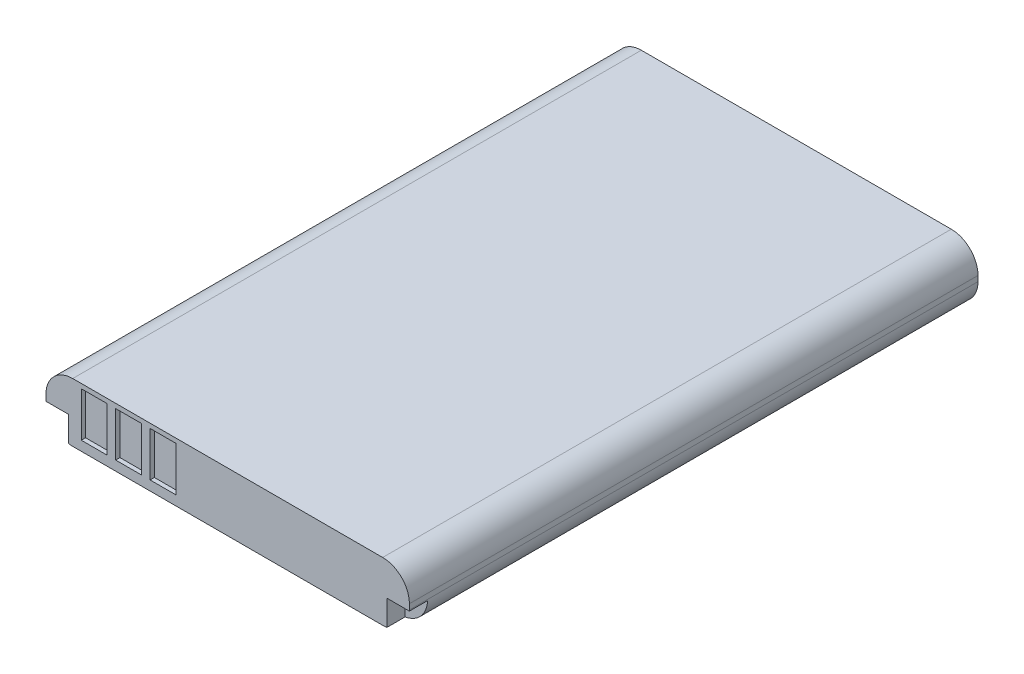
ISO-10303-21;
HEADER;
FILE_DESCRIPTION(('STEP AP214'),'2;1');
FILE_NAME('part.step','',(''),(''),'','','');
FILE_SCHEMA(('AUTOMOTIVE_DESIGN { 1 0 10303 214 1 1 1 1 }'));
ENDSEC;
DATA;
#1=APPLICATION_CONTEXT('core data for automotive mechanical design processes');
#2=APPLICATION_PROTOCOL_DEFINITION('international standard','automotive_design',2000,#1);
#3=PRODUCT_CONTEXT('',#1,'mechanical');
#4=PRODUCT('Part','Part','',(#3));
#5=PRODUCT_RELATED_PRODUCT_CATEGORY('part','',(#4));
#6=PRODUCT_DEFINITION_FORMATION('','',#4);
#7=PRODUCT_DEFINITION_CONTEXT('part definition',#1,'design');
#8=PRODUCT_DEFINITION('design','',#6,#7);
#9=PRODUCT_DEFINITION_SHAPE('','',#8);
#10=(LENGTH_UNIT() NAMED_UNIT(*) SI_UNIT(.MILLI.,.METRE.));
#11=(NAMED_UNIT(*) PLANE_ANGLE_UNIT() SI_UNIT($,.RADIAN.));
#12=(NAMED_UNIT(*) SI_UNIT($,.STERADIAN.) SOLID_ANGLE_UNIT());
#13=UNCERTAINTY_MEASURE_WITH_UNIT(LENGTH_MEASURE(1.E-05),#10,'distance_accuracy_value','');
#14=(GEOMETRIC_REPRESENTATION_CONTEXT(3) GLOBAL_UNCERTAINTY_ASSIGNED_CONTEXT((#13)) GLOBAL_UNIT_ASSIGNED_CONTEXT((#10,
#11,#12)) REPRESENTATION_CONTEXT('',''));
#15=CARTESIAN_POINT('',(0.,0.,0.));
#16=DIRECTION('',(0.,0.,1.));
#17=DIRECTION('',(1.,0.,0.));
#18=AXIS2_PLACEMENT_3D('',#15,#16,#17);
#19=CARTESIAN_POINT('',(-17.,5.5,26.6));
#20=DIRECTION('',(0.,0.,-1.));
#21=DIRECTION('',(-1.,0.,0.));
#22=AXIS2_PLACEMENT_3D('',#19,#20,#21);
#23=PLANE('',#22);
#24=DIRECTION('',(0.,1.,0.));
#25=VECTOR('',#24,1.);
#26=CARTESIAN_POINT('',(-4.86,0.9,26.6));
#27=LINE('',#26,#25);
#28=CARTESIAN_POINT('',(-4.86,0.9,26.6));
#29=VERTEX_POINT('',#28);
#30=CARTESIAN_POINT('',(-4.86,5.075,26.6));
#31=VERTEX_POINT('',#30);
#32=EDGE_CURVE('E421',#29,#31,#27,.T.);
#33=ORIENTED_EDGE('',*,*,#32,.F.);
#34=DIRECTION('',(1.,0.,0.));
#35=VECTOR('',#34,1.);
#36=CARTESIAN_POINT('',(-4.86,0.9,26.6));
#37=LINE('',#36,#35);
#38=CARTESIAN_POINT('',(-7.26,0.9,26.6));
#39=VERTEX_POINT('',#38);
#40=EDGE_CURVE('E423',#39,#29,#37,.T.);
#41=ORIENTED_EDGE('',*,*,#40,.F.);
#42=DIRECTION('',(0.,-1.,0.));
#43=VECTOR('',#42,1.);
#44=CARTESIAN_POINT('',(-7.26,0.9,26.6));
#45=LINE('',#44,#43);
#46=CARTESIAN_POINT('',(-7.26,5.075,26.6));
#47=VERTEX_POINT('',#46);
#48=EDGE_CURVE('E426',#47,#39,#45,.T.);
#49=ORIENTED_EDGE('',*,*,#48,.F.);
#50=DIRECTION('',(-1.,0.,0.));
#51=VECTOR('',#50,1.);
#52=CARTESIAN_POINT('',(-7.26,5.075,26.6));
#53=LINE('',#52,#51);
#54=EDGE_CURVE('E429',#31,#47,#53,.T.);
#55=ORIENTED_EDGE('',*,*,#54,.F.);
#56=EDGE_LOOP('',(#33,#41,#49,#55));
#57=FACE_BOUND('',#56,.T.);
#58=DIRECTION('',(-1.,0.,0.));
#59=VECTOR('',#58,1.);
#60=CARTESIAN_POINT('',(-13.7,5.075,26.6));
#61=LINE('',#60,#59);
#62=CARTESIAN_POINT('',(-11.3,5.075,26.6));
#63=VERTEX_POINT('',#62);
#64=CARTESIAN_POINT('',(-13.7,5.075,26.6));
#65=VERTEX_POINT('',#64);
#66=EDGE_CURVE('E341',#63,#65,#61,.T.);
#67=ORIENTED_EDGE('',*,*,#66,.F.);
#68=DIRECTION('',(0.,1.,0.));
#69=VECTOR('',#68,1.);
#70=CARTESIAN_POINT('',(-11.3,0.9,26.6));
#71=LINE('',#70,#69);
#72=CARTESIAN_POINT('',(-11.3,0.9,26.6));
#73=VERTEX_POINT('',#72);
#74=EDGE_CURVE('E325',#73,#63,#71,.T.);
#75=ORIENTED_EDGE('',*,*,#74,.F.);
#76=DIRECTION('',(1.,0.,0.));
#77=VECTOR('',#76,1.);
#78=CARTESIAN_POINT('',(-11.3,0.9,26.6));
#79=LINE('',#78,#77);
#80=CARTESIAN_POINT('',(-13.7,0.9,26.6));
#81=VERTEX_POINT('',#80);
#82=EDGE_CURVE('E330',#81,#73,#79,.T.);
#83=ORIENTED_EDGE('',*,*,#82,.F.);
#84=DIRECTION('',(0.,-1.,0.));
#85=VECTOR('',#84,1.);
#86=CARTESIAN_POINT('',(-13.7,0.9,26.6));
#87=LINE('',#86,#85);
#88=EDGE_CURVE('E344',#65,#81,#87,.T.);
#89=ORIENTED_EDGE('',*,*,#88,.F.);
#90=EDGE_LOOP('',(#67,#75,#83,#89));
#91=FACE_BOUND('',#90,.T.);
#92=DIRECTION('',(-1.,0.,0.));
#93=VECTOR('',#92,1.);
#94=CARTESIAN_POINT('',(-10.48,5.075,26.6));
#95=LINE('',#94,#93);
#96=CARTESIAN_POINT('',(-8.08,5.075,26.6));
#97=VERTEX_POINT('',#96);
#98=CARTESIAN_POINT('',(-10.48,5.075,26.6));
#99=VERTEX_POINT('',#98);
#100=EDGE_CURVE('E296',#97,#99,#95,.T.);
#101=ORIENTED_EDGE('',*,*,#100,.F.);
#102=DIRECTION('',(0.,1.,0.));
#103=VECTOR('',#102,1.);
#104=CARTESIAN_POINT('',(-8.08,0.9,26.6));
#105=LINE('',#104,#103);
#106=CARTESIAN_POINT('',(-8.08,0.9,26.6));
#107=VERTEX_POINT('',#106);
#108=EDGE_CURVE('E323',#107,#97,#105,.T.);
#109=ORIENTED_EDGE('',*,*,#108,.F.);
#110=DIRECTION('',(1.,0.,0.));
#111=VECTOR('',#110,1.);
#112=CARTESIAN_POINT('',(-8.08,0.9,26.6));
#113=LINE('',#112,#111);
#114=CARTESIAN_POINT('',(-10.48,0.9,26.6));
#115=VERTEX_POINT('',#114);
#116=EDGE_CURVE('E318',#115,#107,#113,.T.);
#117=ORIENTED_EDGE('',*,*,#116,.F.);
#118=DIRECTION('',(0.,-1.,0.));
#119=VECTOR('',#118,1.);
#120=CARTESIAN_POINT('',(-10.48,0.9,26.6));
#121=LINE('',#120,#119);
#122=EDGE_CURVE('E313',#99,#115,#121,.T.);
#123=ORIENTED_EDGE('',*,*,#122,.F.);
#124=EDGE_LOOP('',(#101,#109,#117,#123));
#125=FACE_BOUND('',#124,.T.);
#126=DIRECTION('',(0.,1.,0.));
#127=VECTOR('',#126,1.);
#128=CARTESIAN_POINT('',(14.9,0.,26.6));
#129=LINE('',#128,#127);
#130=CARTESIAN_POINT('',(14.9,0.0322074641493867,26.6));
#131=VERTEX_POINT('',#130);
#132=CARTESIAN_POINT('',(14.9,2.4,26.6));
#133=VERTEX_POINT('',#132);
#134=EDGE_CURVE('E269',#131,#133,#129,.T.);
#135=ORIENTED_EDGE('',*,*,#134,.T.);
#136=DIRECTION('',(1.,0.,0.));
#137=VECTOR('',#136,1.);
#138=CARTESIAN_POINT('',(14.9,2.4,26.6));
#139=LINE('',#138,#137);
#140=CARTESIAN_POINT('',(16.9979991993594,2.4,26.6));
#141=VERTEX_POINT('',#140);
#142=EDGE_CURVE('E275',#133,#141,#139,.T.);
#143=ORIENTED_EDGE('',*,*,#142,.T.);
#144=CARTESIAN_POINT('',(14.5,2.5,26.6));
#145=DIRECTION('',(0.,0.,-1.));
#146=DIRECTION('',(-1.,0.,0.));
#147=AXIS2_PLACEMENT_3D('',#144,#145,#146);
#148=CIRCLE('',#147,2.5);
#149=CARTESIAN_POINT('',(17.,2.5,26.6));
#150=VERTEX_POINT('',#149);
#151=EDGE_CURVE('E388',#141,#150,#148,.F.);
#152=ORIENTED_EDGE('',*,*,#151,.T.);
#153=DIRECTION('',(0.,-1.,0.));
#154=VECTOR('',#153,1.);
#155=CARTESIAN_POINT('',(17.,5.5,26.6));
#156=LINE('',#155,#154);
#157=CARTESIAN_POINT('',(17.,3.,26.6));
#158=VERTEX_POINT('',#157);
#159=EDGE_CURVE('E365',#158,#150,#156,.T.);
#160=ORIENTED_EDGE('',*,*,#159,.F.);
#161=CARTESIAN_POINT('',(14.5,3.,26.6));
#162=DIRECTION('',(0.,0.,-1.));
#163=DIRECTION('',(-1.,0.,0.));
#164=AXIS2_PLACEMENT_3D('',#161,#162,#163);
#165=CIRCLE('',#164,2.5);
#166=CARTESIAN_POINT('',(14.5,5.5,26.6));
#167=VERTEX_POINT('',#166);
#168=EDGE_CURVE('E386',#158,#167,#165,.F.);
#169=ORIENTED_EDGE('',*,*,#168,.T.);
#170=DIRECTION('',(1.,0.,0.));
#171=VECTOR('',#170,1.);
#172=CARTESIAN_POINT('',(-17.,5.5,26.6));
#173=LINE('',#172,#171);
#174=CARTESIAN_POINT('',(-14.5,5.5,26.6));
#175=VERTEX_POINT('',#174);
#176=EDGE_CURVE('E361',#175,#167,#173,.T.);
#177=ORIENTED_EDGE('',*,*,#176,.F.);
#178=CARTESIAN_POINT('',(-14.5,3.,26.6));
#179=DIRECTION('',(0.,0.,-1.));
#180=DIRECTION('',(-1.,0.,0.));
#181=AXIS2_PLACEMENT_3D('',#178,#179,#180);
#182=CIRCLE('',#181,2.5);
#183=CARTESIAN_POINT('',(-17.,3.,26.6));
#184=VERTEX_POINT('',#183);
#185=EDGE_CURVE('E392',#175,#184,#182,.F.);
#186=ORIENTED_EDGE('',*,*,#185,.T.);
#187=DIRECTION('',(0.,-1.,0.));
#188=VECTOR('',#187,1.);
#189=CARTESIAN_POINT('',(-17.,5.5,26.6));
#190=LINE('',#189,#188);
#191=CARTESIAN_POINT('',(-17.,2.5,26.6));
#192=VERTEX_POINT('',#191);
#193=EDGE_CURVE('E372',#184,#192,#190,.T.);
#194=ORIENTED_EDGE('',*,*,#193,.T.);
#195=CARTESIAN_POINT('',(-14.5,2.5,26.6));
#196=DIRECTION('',(0.,0.,-1.));
#197=DIRECTION('',(-1.,0.,0.));
#198=AXIS2_PLACEMENT_3D('',#195,#196,#197);
#199=CIRCLE('',#198,2.5);
#200=CARTESIAN_POINT('',(-16.9979991993594,2.4,26.6));
#201=VERTEX_POINT('',#200);
#202=EDGE_CURVE('E395',#192,#201,#199,.F.);
#203=ORIENTED_EDGE('',*,*,#202,.T.);
#204=DIRECTION('',(-1.,0.,0.));
#205=VECTOR('',#204,1.);
#206=CARTESIAN_POINT('',(-14.9,2.4,26.6));
#207=LINE('',#206,#205);
#208=CARTESIAN_POINT('',(-14.9,2.4,26.6));
#209=VERTEX_POINT('',#208);
#210=EDGE_CURVE('E289',#209,#201,#207,.T.);
#211=ORIENTED_EDGE('',*,*,#210,.F.);
#212=DIRECTION('',(0.,1.,0.));
#213=VECTOR('',#212,1.);
#214=CARTESIAN_POINT('',(-14.9,0.,26.6));
#215=LINE('',#214,#213);
#216=CARTESIAN_POINT('',(-14.9,0.0322074641493867,26.6));
#217=VERTEX_POINT('',#216);
#218=EDGE_CURVE('E285',#217,#209,#215,.T.);
#219=ORIENTED_EDGE('',*,*,#218,.F.);
#220=CARTESIAN_POINT('',(-14.5,0.,26.6));
#221=VERTEX_POINT('',#220);
#222=EDGE_CURVE('E394',#217,#221,#199,.F.);
#223=ORIENTED_EDGE('',*,*,#222,.T.);
#224=DIRECTION('',(1.,0.,0.));
#225=VECTOR('',#224,1.);
#226=CARTESIAN_POINT('',(-17.,0.,26.6));
#227=LINE('',#226,#225);
#228=CARTESIAN_POINT('',(14.5,0.,26.6));
#229=VERTEX_POINT('',#228);
#230=EDGE_CURVE('E362',#221,#229,#227,.T.);
#231=ORIENTED_EDGE('',*,*,#230,.T.);
#232=EDGE_CURVE('E389',#229,#131,#148,.F.);
#233=ORIENTED_EDGE('',*,*,#232,.T.);
#234=EDGE_LOOP('',(#135,#143,#152,#160,#169,#177,#186,#194,#203,#211,#219,#223,#231,#233));
#235=FACE_BOUND('',#234,.T.);
#236=ADVANCED_FACE('F37',(#57,#91,#125,#235),#23,.F.);
#237=CARTESIAN_POINT('',(14.5,2.5,26.6));
#238=DIRECTION('',(0.,0.,1.));
#239=DIRECTION('',(1.,0.,0.));
#240=AXIS2_PLACEMENT_3D('',#237,#238,#239);
#241=CYLINDRICAL_SURFACE('',#240,2.5);
#242=CARTESIAN_POINT('',(14.5,2.5,24.9));
#243=DIRECTION('',(0.,0.,1.));
#244=DIRECTION('',(1.,0.,0.));
#245=AXIS2_PLACEMENT_3D('',#242,#243,#244);
#246=CIRCLE('',#245,2.5);
#247=CARTESIAN_POINT('',(16.9979991993594,2.4,24.9));
#248=VERTEX_POINT('',#247);
#249=CARTESIAN_POINT('',(14.9,0.0322074641493867,24.9));
#250=VERTEX_POINT('',#249);
#251=EDGE_CURVE('E464',#248,#250,#246,.F.);
#252=ORIENTED_EDGE('',*,*,#251,.T.);
#253=DIRECTION('',(0.,0.,1.));
#254=VECTOR('',#253,1.);
#255=CARTESIAN_POINT('',(14.9,0.0322074641493867,26.6));
#256=LINE('',#255,#254);
#257=EDGE_CURVE('E11',#250,#131,#256,.T.);
#258=ORIENTED_EDGE('',*,*,#257,.T.);
#259=ORIENTED_EDGE('',*,*,#232,.F.);
#260=DIRECTION('',(0.,0.,-1.));
#261=VECTOR('',#260,1.);
#262=CARTESIAN_POINT('',(14.5,0.,26.6));
#263=LINE('',#262,#261);
#264=CARTESIAN_POINT('',(14.5,0.,-26.6));
#265=VERTEX_POINT('',#264);
#266=EDGE_CURVE('E398',#265,#229,#263,.F.);
#267=ORIENTED_EDGE('',*,*,#266,.F.);
#268=CARTESIAN_POINT('',(14.5,2.5,-26.6));
#269=DIRECTION('',(0.,0.,1.));
#270=DIRECTION('',(1.,0.,0.));
#271=AXIS2_PLACEMENT_3D('',#268,#269,#270);
#272=CIRCLE('',#271,2.5);
#273=CARTESIAN_POINT('',(17.,2.5,-26.6));
#274=VERTEX_POINT('',#273);
#275=EDGE_CURVE('E404',#274,#265,#272,.F.);
#276=ORIENTED_EDGE('',*,*,#275,.F.);
#277=DIRECTION('',(0.,0.,-1.));
#278=VECTOR('',#277,1.);
#279=CARTESIAN_POINT('',(17.,2.5,-26.6));
#280=LINE('',#279,#278);
#281=EDGE_CURVE('E418',#150,#274,#280,.T.);
#282=ORIENTED_EDGE('',*,*,#281,.F.);
#283=ORIENTED_EDGE('',*,*,#151,.F.);
#284=DIRECTION('',(0.,0.,1.));
#285=VECTOR('',#284,1.);
#286=CARTESIAN_POINT('',(16.9979991993594,2.4,26.6));
#287=LINE('',#286,#285);
#288=EDGE_CURVE('E45',#141,#248,#287,.F.);
#289=ORIENTED_EDGE('',*,*,#288,.T.);
#290=EDGE_LOOP('',(#252,#258,#259,#267,#276,#282,#283,#289));
#291=FACE_BOUND('',#290,.T.);
#292=ADVANCED_FACE('F469',(#291),#241,.T.);
#293=CARTESIAN_POINT('',(6.44,0.,26.2));
#294=DIRECTION('',(0.,0.,-1.));
#295=DIRECTION('',(-1.,0.,0.));
#296=AXIS2_PLACEMENT_3D('',#293,#294,#295);
#297=PLANE('',#296);
#298=DIRECTION('',(0.,1.,0.));
#299=VECTOR('',#298,1.);
#300=CARTESIAN_POINT('',(-4.86,0.9,26.2));
#301=LINE('',#300,#299);
#302=CARTESIAN_POINT('',(-4.86,0.9,26.2));
#303=VERTEX_POINT('',#302);
#304=CARTESIAN_POINT('',(-4.86,5.075,26.2));
#305=VERTEX_POINT('',#304);
#306=EDGE_CURVE('E435',#303,#305,#301,.T.);
#307=ORIENTED_EDGE('',*,*,#306,.T.);
#308=DIRECTION('',(-1.,0.,0.));
#309=VECTOR('',#308,1.);
#310=CARTESIAN_POINT('',(-7.26,5.075,26.2));
#311=LINE('',#310,#309);
#312=CARTESIAN_POINT('',(-7.26,5.075,26.2));
#313=VERTEX_POINT('',#312);
#314=EDGE_CURVE('E453',#305,#313,#311,.T.);
#315=ORIENTED_EDGE('',*,*,#314,.T.);
#316=DIRECTION('',(0.,-1.,0.));
#317=VECTOR('',#316,1.);
#318=CARTESIAN_POINT('',(-7.26,0.9,26.2));
#319=LINE('',#318,#317);
#320=CARTESIAN_POINT('',(-7.26,0.9,26.2));
#321=VERTEX_POINT('',#320);
#322=EDGE_CURVE('E447',#313,#321,#319,.T.);
#323=ORIENTED_EDGE('',*,*,#322,.T.);
#324=DIRECTION('',(1.,0.,0.));
#325=VECTOR('',#324,1.);
#326=CARTESIAN_POINT('',(-4.86,0.9,26.2));
#327=LINE('',#326,#325);
#328=EDGE_CURVE('E441',#321,#303,#327,.T.);
#329=ORIENTED_EDGE('',*,*,#328,.T.);
#330=EDGE_LOOP('',(#307,#315,#323,#329));
#331=FACE_BOUND('',#330,.T.);
#332=ADVANCED_FACE('F39',(#331),#297,.F.);
#333=CARTESIAN_POINT('',(-7.26,5.075,26.2));
#334=DIRECTION('',(0.,1.,0.));
#335=DIRECTION('',(0.,0.,1.));
#336=AXIS2_PLACEMENT_3D('',#333,#334,#335);
#337=PLANE('',#336);
#338=ORIENTED_EDGE('',*,*,#54,.T.);
#339=DIRECTION('',(0.,0.,1.));
#340=VECTOR('',#339,1.);
#341=CARTESIAN_POINT('',(-7.26,5.075,26.2));
#342=LINE('',#341,#340);
#343=EDGE_CURVE('E450',#313,#47,#342,.T.);
#344=ORIENTED_EDGE('',*,*,#343,.F.);
#345=ORIENTED_EDGE('',*,*,#314,.F.);
#346=DIRECTION('',(0.,0.,1.));
#347=VECTOR('',#346,1.);
#348=CARTESIAN_POINT('',(-4.86,5.075,26.2));
#349=LINE('',#348,#347);
#350=EDGE_CURVE('E432',#305,#31,#349,.T.);
#351=ORIENTED_EDGE('',*,*,#350,.T.);
#352=EDGE_LOOP('',(#338,#344,#345,#351));
#353=FACE_BOUND('',#352,.T.);
#354=ADVANCED_FACE('F569',(#353),#337,.F.);
#355=CARTESIAN_POINT('',(-7.26,0.9,26.2));
#356=DIRECTION('',(-1.,0.,0.));
#357=DIRECTION('',(0.,0.,1.));
#358=AXIS2_PLACEMENT_3D('',#355,#356,#357);
#359=PLANE('',#358);
#360=ORIENTED_EDGE('',*,*,#48,.T.);
#361=DIRECTION('',(0.,0.,1.));
#362=VECTOR('',#361,1.);
#363=CARTESIAN_POINT('',(-7.26,0.9,26.2));
#364=LINE('',#363,#362);
#365=EDGE_CURVE('E444',#321,#39,#364,.T.);
#366=ORIENTED_EDGE('',*,*,#365,.F.);
#367=ORIENTED_EDGE('',*,*,#322,.F.);
#368=ORIENTED_EDGE('',*,*,#343,.T.);
#369=EDGE_LOOP('',(#360,#366,#367,#368));
#370=FACE_BOUND('',#369,.T.);
#371=ADVANCED_FACE('F566',(#370),#359,.F.);
#372=CARTESIAN_POINT('',(-4.86,0.9,26.2));
#373=DIRECTION('',(0.,-1.,0.));
#374=DIRECTION('',(1.,0.,0.));
#375=AXIS2_PLACEMENT_3D('',#372,#373,#374);
#376=PLANE('',#375);
#377=ORIENTED_EDGE('',*,*,#40,.T.);
#378=DIRECTION('',(0.,0.,1.));
#379=VECTOR('',#378,1.);
#380=CARTESIAN_POINT('',(-4.86,0.9,26.2));
#381=LINE('',#380,#379);
#382=EDGE_CURVE('E438',#303,#29,#381,.T.);
#383=ORIENTED_EDGE('',*,*,#382,.F.);
#384=ORIENTED_EDGE('',*,*,#328,.F.);
#385=ORIENTED_EDGE('',*,*,#365,.T.);
#386=EDGE_LOOP('',(#377,#383,#384,#385));
#387=FACE_BOUND('',#386,.T.);
#388=ADVANCED_FACE('F562',(#387),#376,.F.);
#389=CARTESIAN_POINT('',(-4.86,0.9,26.2));
#390=DIRECTION('',(1.,0.,0.));
#391=DIRECTION('',(0.,0.,-1.));
#392=AXIS2_PLACEMENT_3D('',#389,#390,#391);
#393=PLANE('',#392);
#394=ORIENTED_EDGE('',*,*,#32,.T.);
#395=ORIENTED_EDGE('',*,*,#350,.F.);
#396=ORIENTED_EDGE('',*,*,#306,.F.);
#397=ORIENTED_EDGE('',*,*,#382,.T.);
#398=EDGE_LOOP('',(#394,#395,#396,#397));
#399=FACE_BOUND('',#398,.T.);
#400=ADVANCED_FACE('F552',(#399),#393,.F.);
#401=CARTESIAN_POINT('',(17.,5.5,26.6));
#402=DIRECTION('',(-1.,0.,0.));
#403=DIRECTION('',(0.,0.,1.));
#404=AXIS2_PLACEMENT_3D('',#401,#402,#403);
#405=PLANE('',#404);
#406=ORIENTED_EDGE('',*,*,#159,.T.);
#407=ORIENTED_EDGE('',*,*,#281,.T.);
#408=DIRECTION('',(0.,-1.,0.));
#409=VECTOR('',#408,1.);
#410=CARTESIAN_POINT('',(17.,5.5,-26.6));
#411=LINE('',#410,#409);
#412=CARTESIAN_POINT('',(17.,3.,-26.6));
#413=VERTEX_POINT('',#412);
#414=EDGE_CURVE('E378',#413,#274,#411,.T.);
#415=ORIENTED_EDGE('',*,*,#414,.F.);
#416=DIRECTION('',(0.,0.,-1.));
#417=VECTOR('',#416,1.);
#418=CARTESIAN_POINT('',(17.,3.,26.6));
#419=LINE('',#418,#417);
#420=EDGE_CURVE('E416',#413,#158,#419,.F.);
#421=ORIENTED_EDGE('',*,*,#420,.T.);
#422=EDGE_LOOP('',(#406,#407,#415,#421));
#423=FACE_BOUND('',#422,.T.);
#424=ADVANCED_FACE('F500',(#423),#405,.F.);
#425=CARTESIAN_POINT('',(-17.,5.5,-26.6));
#426=DIRECTION('',(0.,0.,1.));
#427=DIRECTION('',(1.,0.,0.));
#428=AXIS2_PLACEMENT_3D('',#425,#426,#427);
#429=PLANE('',#428);
#430=DIRECTION('',(1.,0.,0.));
#431=VECTOR('',#430,1.);
#432=CARTESIAN_POINT('',(9.9,4.325,-26.6));
#433=LINE('',#432,#431);
#434=CARTESIAN_POINT('',(-9.9,4.325,-26.6));
#435=VERTEX_POINT('',#434);
#436=CARTESIAN_POINT('',(9.9,4.325,-26.6));
#437=VERTEX_POINT('',#436);
#438=EDGE_CURVE('E263',#435,#437,#433,.T.);
#439=ORIENTED_EDGE('',*,*,#438,.F.);
#440=DIRECTION('',(0.,1.,0.));
#441=VECTOR('',#440,1.);
#442=CARTESIAN_POINT('',(-9.9,1.175,-26.6));
#443=LINE('',#442,#441);
#444=CARTESIAN_POINT('',(-9.9,1.175,-26.6));
#445=VERTEX_POINT('',#444);
#446=EDGE_CURVE('E52',#445,#435,#443,.T.);
#447=ORIENTED_EDGE('',*,*,#446,.F.);
#448=DIRECTION('',(-1.,0.,0.));
#449=VECTOR('',#448,1.);
#450=CARTESIAN_POINT('',(9.9,1.175,-26.6));
#451=LINE('',#450,#449);
#452=CARTESIAN_POINT('',(9.9,1.175,-26.6));
#453=VERTEX_POINT('',#452);
#454=EDGE_CURVE('E254',#453,#445,#451,.T.);
#455=ORIENTED_EDGE('',*,*,#454,.F.);
#456=DIRECTION('',(0.,-1.,0.));
#457=VECTOR('',#456,1.);
#458=CARTESIAN_POINT('',(9.9,1.175,-26.6));
#459=LINE('',#458,#457);
#460=EDGE_CURVE('E257',#437,#453,#459,.T.);
#461=ORIENTED_EDGE('',*,*,#460,.F.);
#462=EDGE_LOOP('',(#439,#447,#455,#461));
#463=FACE_BOUND('',#462,.T.);
#464=DIRECTION('',(-1.,0.,0.));
#465=VECTOR('',#464,1.);
#466=CARTESIAN_POINT('',(-17.,0.,-26.6));
#467=LINE('',#466,#465);
#468=CARTESIAN_POINT('',(-14.5,0.,-26.6));
#469=VERTEX_POINT('',#468);
#470=EDGE_CURVE('E351',#265,#469,#467,.T.);
#471=ORIENTED_EDGE('',*,*,#470,.T.);
#472=CARTESIAN_POINT('',(-14.5,2.5,-26.6));
#473=DIRECTION('',(0.,0.,1.));
#474=DIRECTION('',(1.,0.,0.));
#475=AXIS2_PLACEMENT_3D('',#472,#473,#474);
#476=CIRCLE('',#475,2.5);
#477=CARTESIAN_POINT('',(-17.,2.5,-26.6));
#478=VERTEX_POINT('',#477);
#479=EDGE_CURVE('E408',#469,#478,#476,.F.);
#480=ORIENTED_EDGE('',*,*,#479,.T.);
#481=DIRECTION('',(0.,-1.,0.));
#482=VECTOR('',#481,1.);
#483=CARTESIAN_POINT('',(-17.,5.5,-26.6));
#484=LINE('',#483,#482);
#485=CARTESIAN_POINT('',(-17.,3.,-26.6));
#486=VERTEX_POINT('',#485);
#487=EDGE_CURVE('E375',#486,#478,#484,.T.);
#488=ORIENTED_EDGE('',*,*,#487,.F.);
#489=CARTESIAN_POINT('',(-14.5,3.,-26.6));
#490=DIRECTION('',(0.,0.,1.));
#491=DIRECTION('',(1.,0.,0.));
#492=AXIS2_PLACEMENT_3D('',#489,#490,#491);
#493=CIRCLE('',#492,2.5);
#494=CARTESIAN_POINT('',(-14.5,5.5,-26.6));
#495=VERTEX_POINT('',#494);
#496=EDGE_CURVE('E406',#486,#495,#493,.F.);
#497=ORIENTED_EDGE('',*,*,#496,.T.);
#498=DIRECTION('',(-1.,0.,0.));
#499=VECTOR('',#498,1.);
#500=CARTESIAN_POINT('',(-17.,5.5,-26.6));
#501=LINE('',#500,#499);
#502=CARTESIAN_POINT('',(14.5,5.5,-26.6));
#503=VERTEX_POINT('',#502);
#504=EDGE_CURVE('E358',#503,#495,#501,.T.);
#505=ORIENTED_EDGE('',*,*,#504,.F.);
#506=CARTESIAN_POINT('',(14.5,3.,-26.6));
#507=DIRECTION('',(0.,0.,1.));
#508=DIRECTION('',(1.,0.,0.));
#509=AXIS2_PLACEMENT_3D('',#506,#507,#508);
#510=CIRCLE('',#509,2.5);
#511=EDGE_CURVE('E402',#503,#413,#510,.F.);
#512=ORIENTED_EDGE('',*,*,#511,.T.);
#513=ORIENTED_EDGE('',*,*,#414,.T.);
#514=ORIENTED_EDGE('',*,*,#275,.T.);
#515=EDGE_LOOP('',(#471,#480,#488,#497,#505,#512,#513,#514));
#516=FACE_BOUND('',#515,.T.);
#517=ADVANCED_FACE('F494',(#463,#516),#429,.F.);
#518=CARTESIAN_POINT('',(-17.,5.5,26.6));
#519=DIRECTION('',(1.,0.,0.));
#520=DIRECTION('',(0.,0.,-1.));
#521=AXIS2_PLACEMENT_3D('',#518,#519,#520);
#522=PLANE('',#521);
#523=ORIENTED_EDGE('',*,*,#487,.T.);
#524=DIRECTION('',(0.,0.,1.));
#525=VECTOR('',#524,1.);
#526=CARTESIAN_POINT('',(-17.,2.5,26.6));
#527=LINE('',#526,#525);
#528=EDGE_CURVE('E383',#478,#192,#527,.T.);
#529=ORIENTED_EDGE('',*,*,#528,.T.);
#530=ORIENTED_EDGE('',*,*,#193,.F.);
#531=DIRECTION('',(0.,0.,1.));
#532=VECTOR('',#531,1.);
#533=CARTESIAN_POINT('',(-17.,3.,26.6));
#534=LINE('',#533,#532);
#535=EDGE_CURVE('E381',#184,#486,#534,.F.);
#536=ORIENTED_EDGE('',*,*,#535,.T.);
#537=EDGE_LOOP('',(#523,#529,#530,#536));
#538=FACE_BOUND('',#537,.T.);
#539=ADVANCED_FACE('F515',(#538),#522,.F.);
#540=CARTESIAN_POINT('',(0.,5.5,0.));
#541=DIRECTION('',(0.,-1.,0.));
#542=DIRECTION('',(0.,0.,-1.));
#543=AXIS2_PLACEMENT_3D('',#540,#541,#542);
#544=PLANE('',#543);
#545=ORIENTED_EDGE('',*,*,#504,.T.);
#546=DIRECTION('',(0.,0.,1.));
#547=VECTOR('',#546,1.);
#548=CARTESIAN_POINT('',(-14.5,5.5,0.));
#549=LINE('',#548,#547);
#550=EDGE_CURVE('E413',#495,#175,#549,.T.);
#551=ORIENTED_EDGE('',*,*,#550,.T.);
#552=ORIENTED_EDGE('',*,*,#176,.T.);
#553=DIRECTION('',(0.,0.,-1.));
#554=VECTOR('',#553,1.);
#555=CARTESIAN_POINT('',(14.5,5.5,0.));
#556=LINE('',#555,#554);
#557=EDGE_CURVE('E410',#167,#503,#556,.T.);
#558=ORIENTED_EDGE('',*,*,#557,.T.);
#559=EDGE_LOOP('',(#545,#551,#552,#558));
#560=FACE_BOUND('',#559,.T.);
#561=ADVANCED_FACE('F507',(#560),#544,.F.);
#562=CARTESIAN_POINT('',(0.,0.,0.));
#563=DIRECTION('',(0.,-1.,0.));
#564=DIRECTION('',(0.,0.,-1.));
#565=AXIS2_PLACEMENT_3D('',#562,#563,#564);
#566=PLANE('',#565);
#567=ORIENTED_EDGE('',*,*,#230,.F.);
#568=DIRECTION('',(0.,0.,1.));
#569=VECTOR('',#568,1.);
#570=CARTESIAN_POINT('',(-14.5,0.,-26.6));
#571=LINE('',#570,#569);
#572=EDGE_CURVE('E400',#221,#469,#571,.F.);
#573=ORIENTED_EDGE('',*,*,#572,.T.);
#574=ORIENTED_EDGE('',*,*,#470,.F.);
#575=ORIENTED_EDGE('',*,*,#266,.T.);
#576=EDGE_LOOP('',(#567,#573,#574,#575));
#577=FACE_BOUND('',#576,.T.);
#578=ADVANCED_FACE('F483',(#577),#566,.T.);
#579=CARTESIAN_POINT('',(-14.5,2.5,26.6));
#580=DIRECTION('',(0.,0.,-1.));
#581=DIRECTION('',(-1.,0.,0.));
#582=AXIS2_PLACEMENT_3D('',#579,#580,#581);
#583=CYLINDRICAL_SURFACE('',#582,2.5);
#584=DIRECTION('',(0.,0.,-1.));
#585=VECTOR('',#584,1.);
#586=CARTESIAN_POINT('',(-14.9,0.0322074641493867,26.6));
#587=LINE('',#586,#585);
#588=CARTESIAN_POINT('',(-14.9,0.0322074641493867,24.9));
#589=VERTEX_POINT('',#588);
#590=EDGE_CURVE('E462',#589,#217,#587,.F.);
#591=ORIENTED_EDGE('',*,*,#590,.F.);
#592=CARTESIAN_POINT('',(-14.5,2.5,24.9));
#593=DIRECTION('',(0.,0.,1.));
#594=DIRECTION('',(1.,0.,0.));
#595=AXIS2_PLACEMENT_3D('',#592,#593,#594);
#596=CIRCLE('',#595,2.5);
#597=CARTESIAN_POINT('',(-16.9979991993594,2.4,24.9));
#598=VERTEX_POINT('',#597);
#599=EDGE_CURVE('E456',#589,#598,#596,.F.);
#600=ORIENTED_EDGE('',*,*,#599,.T.);
#601=DIRECTION('',(0.,0.,-1.));
#602=VECTOR('',#601,1.);
#603=CARTESIAN_POINT('',(-16.9979991993594,2.4,26.6));
#604=LINE('',#603,#602);
#605=EDGE_CURVE('E459',#201,#598,#604,.T.);
#606=ORIENTED_EDGE('',*,*,#605,.F.);
#607=ORIENTED_EDGE('',*,*,#202,.F.);
#608=ORIENTED_EDGE('',*,*,#528,.F.);
#609=ORIENTED_EDGE('',*,*,#479,.F.);
#610=ORIENTED_EDGE('',*,*,#572,.F.);
#611=ORIENTED_EDGE('',*,*,#222,.F.);
#612=EDGE_LOOP('',(#591,#600,#606,#607,#608,#609,#610,#611));
#613=FACE_BOUND('',#612,.T.);
#614=ADVANCED_FACE('F490',(#613),#583,.T.);
#615=CARTESIAN_POINT('',(-14.5,3.,0.));
#616=DIRECTION('',(0.,0.,1.));
#617=DIRECTION('',(1.,0.,0.));
#618=AXIS2_PLACEMENT_3D('',#615,#616,#617);
#619=CYLINDRICAL_SURFACE('',#618,2.5);
#620=ORIENTED_EDGE('',*,*,#496,.F.);
#621=ORIENTED_EDGE('',*,*,#535,.F.);
#622=ORIENTED_EDGE('',*,*,#185,.F.);
#623=ORIENTED_EDGE('',*,*,#550,.F.);
#624=EDGE_LOOP('',(#620,#621,#622,#623));
#625=FACE_BOUND('',#624,.T.);
#626=ADVANCED_FACE('F511',(#625),#619,.T.);
#627=CARTESIAN_POINT('',(14.5,3.,0.));
#628=DIRECTION('',(0.,0.,-1.));
#629=DIRECTION('',(-1.,0.,0.));
#630=AXIS2_PLACEMENT_3D('',#627,#628,#629);
#631=CYLINDRICAL_SURFACE('',#630,2.5);
#632=ORIENTED_EDGE('',*,*,#168,.F.);
#633=ORIENTED_EDGE('',*,*,#420,.F.);
#634=ORIENTED_EDGE('',*,*,#511,.F.);
#635=ORIENTED_EDGE('',*,*,#557,.F.);
#636=EDGE_LOOP('',(#632,#633,#634,#635));
#637=FACE_BOUND('',#636,.T.);
#638=ADVANCED_FACE('F503',(#637),#631,.T.);
#639=CARTESIAN_POINT('',(-11.3,0.9,26.2));
#640=DIRECTION('',(1.,0.,0.));
#641=DIRECTION('',(0.,0.,-1.));
#642=AXIS2_PLACEMENT_3D('',#639,#640,#641);
#643=PLANE('',#642);
#644=ORIENTED_EDGE('',*,*,#74,.T.);
#645=DIRECTION('',(0.,0.,1.));
#646=VECTOR('',#645,1.);
#647=CARTESIAN_POINT('',(-11.3,5.075,26.2));
#648=LINE('',#647,#646);
#649=CARTESIAN_POINT('',(-11.3,5.075,26.2));
#650=VERTEX_POINT('',#649);
#651=EDGE_CURVE('E339',#650,#63,#648,.T.);
#652=ORIENTED_EDGE('',*,*,#651,.F.);
#653=DIRECTION('',(0.,1.,0.));
#654=VECTOR('',#653,1.);
#655=CARTESIAN_POINT('',(-11.3,0.9,26.2));
#656=LINE('',#655,#654);
#657=CARTESIAN_POINT('',(-11.3,0.9,26.2));
#658=VERTEX_POINT('',#657);
#659=EDGE_CURVE('E326',#658,#650,#656,.T.);
#660=ORIENTED_EDGE('',*,*,#659,.F.);
#661=DIRECTION('',(0.,0.,1.));
#662=VECTOR('',#661,1.);
#663=CARTESIAN_POINT('',(-11.3,0.9,26.2));
#664=LINE('',#663,#662);
#665=EDGE_CURVE('E349',#658,#73,#664,.T.);
#666=ORIENTED_EDGE('',*,*,#665,.T.);
#667=EDGE_LOOP('',(#644,#652,#660,#666));
#668=FACE_BOUND('',#667,.T.);
#669=ADVANCED_FACE('F559',(#668),#643,.F.);
#670=CARTESIAN_POINT('',(-11.3,0.9,26.2));
#671=DIRECTION('',(0.,-1.,0.));
#672=DIRECTION('',(1.,0.,0.));
#673=AXIS2_PLACEMENT_3D('',#670,#671,#672);
#674=PLANE('',#673);
#675=ORIENTED_EDGE('',*,*,#82,.T.);
#676=ORIENTED_EDGE('',*,*,#665,.F.);
#677=DIRECTION('',(1.,0.,0.));
#678=VECTOR('',#677,1.);
#679=CARTESIAN_POINT('',(-11.3,0.9,26.2));
#680=LINE('',#679,#678);
#681=CARTESIAN_POINT('',(-13.7,0.9,26.2));
#682=VERTEX_POINT('',#681);
#683=EDGE_CURVE('E336',#682,#658,#680,.T.);
#684=ORIENTED_EDGE('',*,*,#683,.F.);
#685=DIRECTION('',(0.,0.,1.));
#686=VECTOR('',#685,1.);
#687=CARTESIAN_POINT('',(-13.7,0.9,26.2));
#688=LINE('',#687,#686);
#689=EDGE_CURVE('E352',#682,#81,#688,.T.);
#690=ORIENTED_EDGE('',*,*,#689,.T.);
#691=EDGE_LOOP('',(#675,#676,#684,#690));
#692=FACE_BOUND('',#691,.T.);
#693=ADVANCED_FACE('F707',(#692),#674,.F.);
#694=CARTESIAN_POINT('',(-13.7,0.9,26.2));
#695=DIRECTION('',(-1.,0.,0.));
#696=DIRECTION('',(0.,0.,1.));
#697=AXIS2_PLACEMENT_3D('',#694,#695,#696);
#698=PLANE('',#697);
#699=ORIENTED_EDGE('',*,*,#88,.T.);
#700=ORIENTED_EDGE('',*,*,#689,.F.);
#701=DIRECTION('',(0.,-1.,0.));
#702=VECTOR('',#701,1.);
#703=CARTESIAN_POINT('',(-13.7,0.9,26.2));
#704=LINE('',#703,#702);
#705=CARTESIAN_POINT('',(-13.7,5.075,26.2));
#706=VERTEX_POINT('',#705);
#707=EDGE_CURVE('E333',#706,#682,#704,.T.);
#708=ORIENTED_EDGE('',*,*,#707,.F.);
#709=DIRECTION('',(0.,0.,1.));
#710=VECTOR('',#709,1.);
#711=CARTESIAN_POINT('',(-13.7,5.075,26.2));
#712=LINE('',#711,#710);
#713=EDGE_CURVE('E354',#706,#65,#712,.T.);
#714=ORIENTED_EDGE('',*,*,#713,.T.);
#715=EDGE_LOOP('',(#699,#700,#708,#714));
#716=FACE_BOUND('',#715,.T.);
#717=ADVANCED_FACE('F715',(#716),#698,.F.);
#718=CARTESIAN_POINT('',(-13.7,5.075,26.2));
#719=DIRECTION('',(0.,1.,0.));
#720=DIRECTION('',(0.,0.,1.));
#721=AXIS2_PLACEMENT_3D('',#718,#719,#720);
#722=PLANE('',#721);
#723=ORIENTED_EDGE('',*,*,#66,.T.);
#724=ORIENTED_EDGE('',*,*,#713,.F.);
#725=DIRECTION('',(-1.,0.,0.));
#726=VECTOR('',#725,1.);
#727=CARTESIAN_POINT('',(-13.7,5.075,26.2));
#728=LINE('',#727,#726);
#729=EDGE_CURVE('E329',#650,#706,#728,.T.);
#730=ORIENTED_EDGE('',*,*,#729,.F.);
#731=ORIENTED_EDGE('',*,*,#651,.T.);
#732=EDGE_LOOP('',(#723,#724,#730,#731));
#733=FACE_BOUND('',#732,.T.);
#734=ADVANCED_FACE('F723',(#733),#722,.F.);
#735=CARTESIAN_POINT('',(0.,0.,26.2));
#736=DIRECTION('',(0.,0.,-1.));
#737=DIRECTION('',(-1.,0.,0.));
#738=AXIS2_PLACEMENT_3D('',#735,#736,#737);
#739=PLANE('',#738);
#740=ORIENTED_EDGE('',*,*,#659,.T.);
#741=ORIENTED_EDGE('',*,*,#729,.T.);
#742=ORIENTED_EDGE('',*,*,#707,.T.);
#743=ORIENTED_EDGE('',*,*,#683,.T.);
#744=EDGE_LOOP('',(#740,#741,#742,#743));
#745=FACE_BOUND('',#744,.T.);
#746=ADVANCED_FACE('F731',(#745),#739,.F.);
#747=CARTESIAN_POINT('',(-8.08,0.9,26.2));
#748=DIRECTION('',(1.,0.,0.));
#749=DIRECTION('',(0.,0.,-1.));
#750=AXIS2_PLACEMENT_3D('',#747,#748,#749);
#751=PLANE('',#750);
#752=ORIENTED_EDGE('',*,*,#108,.T.);
#753=DIRECTION('',(0.,0.,1.));
#754=VECTOR('',#753,1.);
#755=CARTESIAN_POINT('',(-8.08,5.075,26.2));
#756=LINE('',#755,#754);
#757=CARTESIAN_POINT('',(-8.08,5.075,26.2));
#758=VERTEX_POINT('',#757);
#759=EDGE_CURVE('E310',#758,#97,#756,.T.);
#760=ORIENTED_EDGE('',*,*,#759,.F.);
#761=DIRECTION('',(0.,1.,0.));
#762=VECTOR('',#761,1.);
#763=CARTESIAN_POINT('',(-8.08,0.9,26.2));
#764=LINE('',#763,#762);
#765=CARTESIAN_POINT('',(-8.08,0.9,26.2));
#766=VERTEX_POINT('',#765);
#767=EDGE_CURVE('E298',#766,#758,#764,.T.);
#768=ORIENTED_EDGE('',*,*,#767,.F.);
#769=DIRECTION('',(0.,0.,1.));
#770=VECTOR('',#769,1.);
#771=CARTESIAN_POINT('',(-8.08,0.9,26.2));
#772=LINE('',#771,#770);
#773=EDGE_CURVE('E320',#766,#107,#772,.T.);
#774=ORIENTED_EDGE('',*,*,#773,.T.);
#775=EDGE_LOOP('',(#752,#760,#768,#774));
#776=FACE_BOUND('',#775,.T.);
#777=ADVANCED_FACE('F739',(#776),#751,.F.);
#778=CARTESIAN_POINT('',(-8.08,0.9,26.2));
#779=DIRECTION('',(0.,-1.,0.));
#780=DIRECTION('',(1.,0.,0.));
#781=AXIS2_PLACEMENT_3D('',#778,#779,#780);
#782=PLANE('',#781);
#783=ORIENTED_EDGE('',*,*,#116,.T.);
#784=ORIENTED_EDGE('',*,*,#773,.F.);
#785=DIRECTION('',(1.,0.,0.));
#786=VECTOR('',#785,1.);
#787=CARTESIAN_POINT('',(-8.08,0.9,26.2));
#788=LINE('',#787,#786);
#789=CARTESIAN_POINT('',(-10.48,0.9,26.2));
#790=VERTEX_POINT('',#789);
#791=EDGE_CURVE('E304',#790,#766,#788,.T.);
#792=ORIENTED_EDGE('',*,*,#791,.F.);
#793=DIRECTION('',(0.,0.,1.));
#794=VECTOR('',#793,1.);
#795=CARTESIAN_POINT('',(-10.48,0.9,26.2));
#796=LINE('',#795,#794);
#797=EDGE_CURVE('E315',#790,#115,#796,.T.);
#798=ORIENTED_EDGE('',*,*,#797,.T.);
#799=EDGE_LOOP('',(#783,#784,#792,#798));
#800=FACE_BOUND('',#799,.T.);
#801=ADVANCED_FACE('F747',(#800),#782,.F.);
#802=CARTESIAN_POINT('',(-10.48,0.9,26.2));
#803=DIRECTION('',(-1.,0.,0.));
#804=DIRECTION('',(0.,0.,1.));
#805=AXIS2_PLACEMENT_3D('',#802,#803,#804);
#806=PLANE('',#805);
#807=ORIENTED_EDGE('',*,*,#122,.T.);
#808=ORIENTED_EDGE('',*,*,#797,.F.);
#809=DIRECTION('',(0.,-1.,0.));
#810=VECTOR('',#809,1.);
#811=CARTESIAN_POINT('',(-10.48,0.9,26.2));
#812=LINE('',#811,#810);
#813=CARTESIAN_POINT('',(-10.48,5.075,26.2));
#814=VERTEX_POINT('',#813);
#815=EDGE_CURVE('E302',#814,#790,#812,.T.);
#816=ORIENTED_EDGE('',*,*,#815,.F.);
#817=DIRECTION('',(0.,0.,1.));
#818=VECTOR('',#817,1.);
#819=CARTESIAN_POINT('',(-10.48,5.075,26.2));
#820=LINE('',#819,#818);
#821=EDGE_CURVE('E307',#814,#99,#820,.T.);
#822=ORIENTED_EDGE('',*,*,#821,.T.);
#823=EDGE_LOOP('',(#807,#808,#816,#822));
#824=FACE_BOUND('',#823,.T.);
#825=ADVANCED_FACE('F757',(#824),#806,.F.);
#826=CARTESIAN_POINT('',(-10.48,5.075,26.2));
#827=DIRECTION('',(0.,1.,0.));
#828=DIRECTION('',(0.,0.,1.));
#829=AXIS2_PLACEMENT_3D('',#826,#827,#828);
#830=PLANE('',#829);
#831=ORIENTED_EDGE('',*,*,#100,.T.);
#832=ORIENTED_EDGE('',*,*,#821,.F.);
#833=DIRECTION('',(-1.,0.,0.));
#834=VECTOR('',#833,1.);
#835=CARTESIAN_POINT('',(-10.48,5.075,26.2));
#836=LINE('',#835,#834);
#837=EDGE_CURVE('E300',#758,#814,#836,.T.);
#838=ORIENTED_EDGE('',*,*,#837,.F.);
#839=ORIENTED_EDGE('',*,*,#759,.T.);
#840=EDGE_LOOP('',(#831,#832,#838,#839));
#841=FACE_BOUND('',#840,.T.);
#842=ADVANCED_FACE('F766',(#841),#830,.F.);
#843=CARTESIAN_POINT('',(3.22,0.,26.2));
#844=DIRECTION('',(0.,0.,-1.));
#845=DIRECTION('',(-1.,0.,0.));
#846=AXIS2_PLACEMENT_3D('',#843,#844,#845);
#847=PLANE('',#846);
#848=ORIENTED_EDGE('',*,*,#767,.T.);
#849=ORIENTED_EDGE('',*,*,#837,.T.);
#850=ORIENTED_EDGE('',*,*,#815,.T.);
#851=ORIENTED_EDGE('',*,*,#791,.T.);
#852=EDGE_LOOP('',(#848,#849,#850,#851));
#853=FACE_BOUND('',#852,.T.);
#854=ADVANCED_FACE('F773',(#853),#847,.F.);
#855=CARTESIAN_POINT('',(-14.9,0.,24.9));
#856=DIRECTION('',(1.,0.,0.));
#857=DIRECTION('',(0.,0.,-1.));
#858=AXIS2_PLACEMENT_3D('',#855,#856,#857);
#859=PLANE('',#858);
#860=ORIENTED_EDGE('',*,*,#590,.T.);
#861=ORIENTED_EDGE('',*,*,#218,.T.);
#862=DIRECTION('',(0.,0.,1.));
#863=VECTOR('',#862,1.);
#864=CARTESIAN_POINT('',(-14.9,2.4,24.9));
#865=LINE('',#864,#863);
#866=CARTESIAN_POINT('',(-14.9,2.4,24.9));
#867=VERTEX_POINT('',#866);
#868=EDGE_CURVE('E291',#867,#209,#865,.T.);
#869=ORIENTED_EDGE('',*,*,#868,.F.);
#870=DIRECTION('',(0.,1.,0.));
#871=VECTOR('',#870,1.);
#872=CARTESIAN_POINT('',(-14.9,0.,24.9));
#873=LINE('',#872,#871);
#874=EDGE_CURVE('E286',#589,#867,#873,.T.);
#875=ORIENTED_EDGE('',*,*,#874,.F.);
#876=EDGE_LOOP('',(#860,#861,#869,#875));
#877=FACE_BOUND('',#876,.T.);
#878=ADVANCED_FACE('F523',(#877),#859,.F.);
#879=CARTESIAN_POINT('',(-14.9,2.4,24.9));
#880=DIRECTION('',(0.,1.,0.));
#881=DIRECTION('',(-1.,0.,0.));
#882=AXIS2_PLACEMENT_3D('',#879,#880,#881);
#883=PLANE('',#882);
#884=ORIENTED_EDGE('',*,*,#605,.T.);
#885=DIRECTION('',(-1.,0.,0.));
#886=VECTOR('',#885,1.);
#887=CARTESIAN_POINT('',(-14.9,2.4,24.9));
#888=LINE('',#887,#886);
#889=EDGE_CURVE('E288',#867,#598,#888,.T.);
#890=ORIENTED_EDGE('',*,*,#889,.F.);
#891=ORIENTED_EDGE('',*,*,#868,.T.);
#892=ORIENTED_EDGE('',*,*,#210,.T.);
#893=EDGE_LOOP('',(#884,#890,#891,#892));
#894=FACE_BOUND('',#893,.T.);
#895=ADVANCED_FACE('F518',(#894),#883,.F.);
#896=CARTESIAN_POINT('',(0.,0.,24.9));
#897=DIRECTION('',(0.,0.,1.));
#898=DIRECTION('',(1.,0.,0.));
#899=AXIS2_PLACEMENT_3D('',#896,#897,#898);
#900=PLANE('',#899);
#901=ORIENTED_EDGE('',*,*,#874,.T.);
#902=ORIENTED_EDGE('',*,*,#889,.T.);
#903=ORIENTED_EDGE('',*,*,#599,.F.);
#904=EDGE_LOOP('',(#901,#902,#903));
#905=FACE_BOUND('',#904,.T.);
#906=ADVANCED_FACE('F525',(#905),#900,.T.);
#907=CARTESIAN_POINT('',(14.9,0.,24.9));
#908=DIRECTION('',(1.,0.,0.));
#909=DIRECTION('',(0.,0.,-1.));
#910=AXIS2_PLACEMENT_3D('',#907,#908,#909);
#911=PLANE('',#910);
#912=DIRECTION('',(0.,1.,0.));
#913=VECTOR('',#912,1.);
#914=CARTESIAN_POINT('',(14.9,0.,24.9));
#915=LINE('',#914,#913);
#916=CARTESIAN_POINT('',(14.9,2.4,24.9));
#917=VERTEX_POINT('',#916);
#918=EDGE_CURVE('E60',#250,#917,#915,.T.);
#919=ORIENTED_EDGE('',*,*,#918,.T.);
#920=DIRECTION('',(0.,0.,1.));
#921=VECTOR('',#920,1.);
#922=CARTESIAN_POINT('',(14.9,2.4,24.9));
#923=LINE('',#922,#921);
#924=EDGE_CURVE('E278',#917,#133,#923,.T.);
#925=ORIENTED_EDGE('',*,*,#924,.T.);
#926=ORIENTED_EDGE('',*,*,#134,.F.);
#927=ORIENTED_EDGE('',*,*,#257,.F.);
#928=EDGE_LOOP('',(#919,#925,#926,#927));
#929=FACE_BOUND('',#928,.T.);
#930=ADVANCED_FACE('F478',(#929),#911,.T.);
#931=CARTESIAN_POINT('',(14.9,2.4,24.9));
#932=DIRECTION('',(0.,-1.,0.));
#933=DIRECTION('',(1.,0.,0.));
#934=AXIS2_PLACEMENT_3D('',#931,#932,#933);
#935=PLANE('',#934);
#936=ORIENTED_EDGE('',*,*,#142,.F.);
#937=ORIENTED_EDGE('',*,*,#924,.F.);
#938=DIRECTION('',(1.,0.,0.));
#939=VECTOR('',#938,1.);
#940=CARTESIAN_POINT('',(14.9,2.4,24.9));
#941=LINE('',#940,#939);
#942=EDGE_CURVE('E274',#917,#248,#941,.T.);
#943=ORIENTED_EDGE('',*,*,#942,.T.);
#944=ORIENTED_EDGE('',*,*,#288,.F.);
#945=EDGE_LOOP('',(#936,#937,#943,#944));
#946=FACE_BOUND('',#945,.T.);
#947=ADVANCED_FACE('F472',(#946),#935,.T.);
#948=CARTESIAN_POINT('',(0.,0.,24.9));
#949=DIRECTION('',(0.,0.,1.));
#950=DIRECTION('',(-1.,0.,0.));
#951=AXIS2_PLACEMENT_3D('',#948,#949,#950);
#952=PLANE('',#951);
#953=ORIENTED_EDGE('',*,*,#942,.F.);
#954=ORIENTED_EDGE('',*,*,#918,.F.);
#955=ORIENTED_EDGE('',*,*,#251,.F.);
#956=EDGE_LOOP('',(#953,#954,#955));
#957=FACE_BOUND('',#956,.T.);
#958=ADVANCED_FACE('F608',(#957),#952,.T.);
#959=CARTESIAN_POINT('',(-9.9,1.175,-26.5));
#960=DIRECTION('',(-1.,0.,0.));
#961=DIRECTION('',(0.,0.,1.));
#962=AXIS2_PLACEMENT_3D('',#959,#960,#961);
#963=PLANE('',#962);
#964=ORIENTED_EDGE('',*,*,#446,.T.);
#965=DIRECTION('',(0.,0.,-1.));
#966=VECTOR('',#965,1.);
#967=CARTESIAN_POINT('',(-9.9,4.325,-26.5));
#968=LINE('',#967,#966);
#969=CARTESIAN_POINT('',(-9.9,4.325,-26.5));
#970=VERTEX_POINT('',#969);
#971=EDGE_CURVE('E232',#970,#435,#968,.T.);
#972=ORIENTED_EDGE('',*,*,#971,.F.);
#973=DIRECTION('',(0.,1.,0.));
#974=VECTOR('',#973,1.);
#975=CARTESIAN_POINT('',(-9.9,1.175,-26.5));
#976=LINE('',#975,#974);
#977=CARTESIAN_POINT('',(-9.9,1.175,-26.5));
#978=VERTEX_POINT('',#977);
#979=EDGE_CURVE('E236',#978,#970,#976,.T.);
#980=ORIENTED_EDGE('',*,*,#979,.F.);
#981=DIRECTION('',(0.,0.,-1.));
#982=VECTOR('',#981,1.);
#983=CARTESIAN_POINT('',(-9.9,1.175,-26.5));
#984=LINE('',#983,#982);
#985=EDGE_CURVE('E267',#978,#445,#984,.T.);
#986=ORIENTED_EDGE('',*,*,#985,.T.);
#987=EDGE_LOOP('',(#964,#972,#980,#986));
#988=FACE_BOUND('',#987,.T.);
#989=ADVANCED_FACE('F234',(#988),#963,.F.);
#990=CARTESIAN_POINT('',(9.9,1.175,-26.5));
#991=DIRECTION('',(0.,-1.,0.));
#992=DIRECTION('',(0.,0.,-1.));
#993=AXIS2_PLACEMENT_3D('',#990,#991,#992);
#994=PLANE('',#993);
#995=ORIENTED_EDGE('',*,*,#454,.T.);
#996=ORIENTED_EDGE('',*,*,#985,.F.);
#997=DIRECTION('',(-1.,0.,0.));
#998=VECTOR('',#997,1.);
#999=CARTESIAN_POINT('',(9.9,1.175,-26.5));
#1000=LINE('',#999,#998);
#1001=CARTESIAN_POINT('',(9.9,1.175,-26.5));
#1002=VERTEX_POINT('',#1001);
#1003=EDGE_CURVE('E242',#1002,#978,#1000,.T.);
#1004=ORIENTED_EDGE('',*,*,#1003,.F.);
#1005=DIRECTION('',(0.,0.,-1.));
#1006=VECTOR('',#1005,1.);
#1007=CARTESIAN_POINT('',(9.9,1.175,-26.5));
#1008=LINE('',#1007,#1006);
#1009=EDGE_CURVE('E270',#1002,#453,#1008,.T.);
#1010=ORIENTED_EDGE('',*,*,#1009,.T.);
#1011=EDGE_LOOP('',(#995,#996,#1004,#1010));
#1012=FACE_BOUND('',#1011,.T.);
#1013=ADVANCED_FACE('F629',(#1012),#994,.F.);
#1014=CARTESIAN_POINT('',(9.9,1.175,-26.5));
#1015=DIRECTION('',(1.,0.,0.));
#1016=DIRECTION('',(0.,0.,-1.));
#1017=AXIS2_PLACEMENT_3D('',#1014,#1015,#1016);
#1018=PLANE('',#1017);
#1019=ORIENTED_EDGE('',*,*,#460,.T.);
#1020=ORIENTED_EDGE('',*,*,#1009,.F.);
#1021=DIRECTION('',(0.,-1.,0.));
#1022=VECTOR('',#1021,1.);
#1023=CARTESIAN_POINT('',(9.9,1.175,-26.5));
#1024=LINE('',#1023,#1022);
#1025=CARTESIAN_POINT('',(9.9,4.325,-26.5));
#1026=VERTEX_POINT('',#1025);
#1027=EDGE_CURVE('E250',#1026,#1002,#1024,.T.);
#1028=ORIENTED_EDGE('',*,*,#1027,.F.);
#1029=DIRECTION('',(0.,0.,-1.));
#1030=VECTOR('',#1029,1.);
#1031=CARTESIAN_POINT('',(9.9,4.325,-26.5));
#1032=LINE('',#1031,#1030);
#1033=EDGE_CURVE('E241',#1026,#437,#1032,.T.);
#1034=ORIENTED_EDGE('',*,*,#1033,.T.);
#1035=EDGE_LOOP('',(#1019,#1020,#1028,#1034));
#1036=FACE_BOUND('',#1035,.T.);
#1037=ADVANCED_FACE('F638',(#1036),#1018,.F.);
#1038=CARTESIAN_POINT('',(9.9,4.325,-26.5));
#1039=DIRECTION('',(0.,1.,0.));
#1040=DIRECTION('',(0.,0.,1.));
#1041=AXIS2_PLACEMENT_3D('',#1038,#1039,#1040);
#1042=PLANE('',#1041);
#1043=ORIENTED_EDGE('',*,*,#438,.T.);
#1044=ORIENTED_EDGE('',*,*,#1033,.F.);
#1045=DIRECTION('',(1.,0.,0.));
#1046=VECTOR('',#1045,1.);
#1047=CARTESIAN_POINT('',(9.9,4.325,-26.5));
#1048=LINE('',#1047,#1046);
#1049=EDGE_CURVE('E245',#970,#1026,#1048,.T.);
#1050=ORIENTED_EDGE('',*,*,#1049,.F.);
#1051=ORIENTED_EDGE('',*,*,#971,.T.);
#1052=EDGE_LOOP('',(#1043,#1044,#1050,#1051));
#1053=FACE_BOUND('',#1052,.T.);
#1054=ADVANCED_FACE('F246',(#1053),#1042,.F.);
#1055=CARTESIAN_POINT('',(0.,0.,-26.5));
#1056=DIRECTION('',(0.,0.,1.));
#1057=DIRECTION('',(1.,0.,0.));
#1058=AXIS2_PLACEMENT_3D('',#1055,#1056,#1057);
#1059=PLANE('',#1058);
#1060=ORIENTED_EDGE('',*,*,#979,.T.);
#1061=ORIENTED_EDGE('',*,*,#1049,.T.);
#1062=ORIENTED_EDGE('',*,*,#1027,.T.);
#1063=ORIENTED_EDGE('',*,*,#1003,.T.);
#1064=EDGE_LOOP('',(#1060,#1061,#1062,#1063));
#1065=FACE_BOUND('',#1064,.T.);
#1066=ADVANCED_FACE('F252',(#1065),#1059,.F.);
#1067=CLOSED_SHELL('',(#236,#292,#332,#354,#371,#388,#400,#424,#517,#539,#561,#578,#614,#626,
#638,#669,#693,#717,#734,#746,#777,#801,#825,#842,#854,#878,#895,#906,#930,#947,#958,#989,#1013,
#1037,#1054,#1066));
#1068=MANIFOLD_SOLID_BREP('B2',#1067);
#1069=ADVANCED_BREP_SHAPE_REPRESENTATION('',(#18,#1068),#14);
#1070=SHAPE_DEFINITION_REPRESENTATION(#9,#1069);
ENDSEC;
END-ISO-10303-21;
